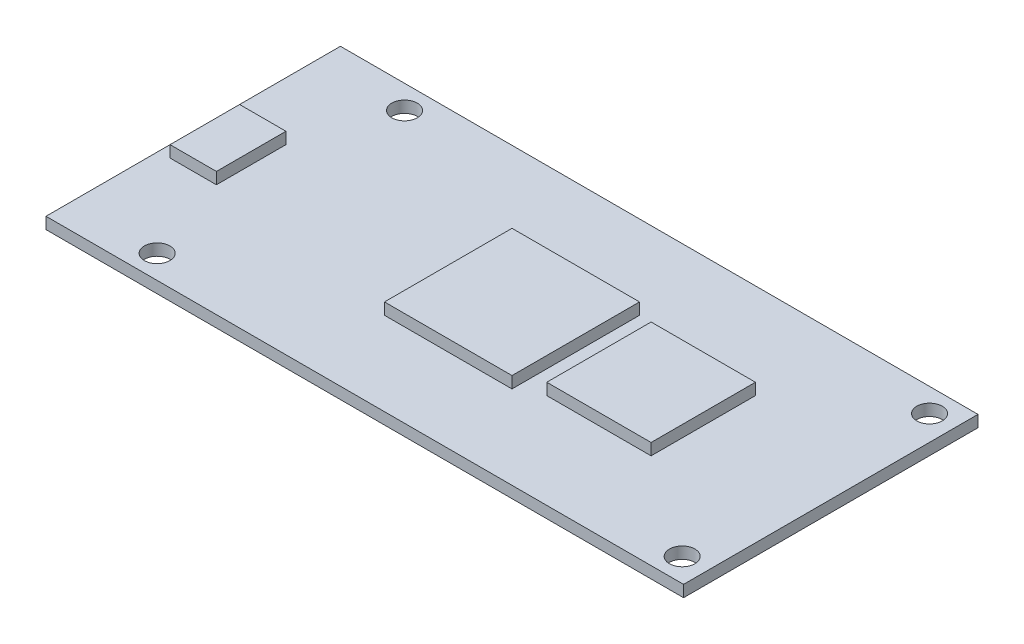
ISO-10303-21;
HEADER;
FILE_DESCRIPTION(('STEP AP214'),'2;1');
FILE_NAME('part.step','',(''),(''),'','','');
FILE_SCHEMA(('AUTOMOTIVE_DESIGN { 1 0 10303 214 1 1 1 1 }'));
ENDSEC;
DATA;
#1=APPLICATION_CONTEXT('core data for automotive mechanical design processes');
#2=APPLICATION_PROTOCOL_DEFINITION('international standard','automotive_design',2000,#1);
#3=PRODUCT_CONTEXT('',#1,'mechanical');
#4=PRODUCT('Part','Part','',(#3));
#5=PRODUCT_RELATED_PRODUCT_CATEGORY('part','',(#4));
#6=PRODUCT_DEFINITION_FORMATION('','',#4);
#7=PRODUCT_DEFINITION_CONTEXT('part definition',#1,'design');
#8=PRODUCT_DEFINITION('design','',#6,#7);
#9=PRODUCT_DEFINITION_SHAPE('','',#8);
#10=(LENGTH_UNIT() NAMED_UNIT(*) SI_UNIT(.MILLI.,.METRE.));
#11=(NAMED_UNIT(*) PLANE_ANGLE_UNIT() SI_UNIT($,.RADIAN.));
#12=(NAMED_UNIT(*) SI_UNIT($,.STERADIAN.) SOLID_ANGLE_UNIT());
#13=UNCERTAINTY_MEASURE_WITH_UNIT(LENGTH_MEASURE(1.E-05),#10,'distance_accuracy_value','');
#14=(GEOMETRIC_REPRESENTATION_CONTEXT(3) GLOBAL_UNCERTAINTY_ASSIGNED_CONTEXT((#13)) GLOBAL_UNIT_ASSIGNED_CONTEXT((#10,
#11,#12)) REPRESENTATION_CONTEXT('',''));
#15=CARTESIAN_POINT('',(0.,0.,0.));
#16=DIRECTION('',(0.,0.,1.));
#17=DIRECTION('',(1.,0.,0.));
#18=AXIS2_PLACEMENT_3D('',#15,#16,#17);
#19=CARTESIAN_POINT('',(27.5,1.,0.));
#20=DIRECTION('',(1.,0.,0.));
#21=DIRECTION('',(0.,0.,-1.));
#22=AXIS2_PLACEMENT_3D('',#19,#20,#21);
#23=PLANE('',#22);
#24=DIRECTION('',(0.,0.,1.));
#25=VECTOR('',#24,1.);
#26=CARTESIAN_POINT('',(27.5,0.,0.));
#27=LINE('',#26,#25);
#28=CARTESIAN_POINT('',(27.5,0.,-12.7));
#29=VERTEX_POINT('',#28);
#30=CARTESIAN_POINT('',(27.5,0.,12.7));
#31=VERTEX_POINT('',#30);
#32=EDGE_CURVE('E204',#29,#31,#27,.T.);
#33=ORIENTED_EDGE('',*,*,#32,.F.);
#34=DIRECTION('',(0.,-1.,0.));
#35=VECTOR('',#34,1.);
#36=CARTESIAN_POINT('',(27.5,1.,-12.7));
#37=LINE('',#36,#35);
#38=CARTESIAN_POINT('',(27.5,1.,-12.7));
#39=VERTEX_POINT('',#38);
#40=EDGE_CURVE('E11',#39,#29,#37,.T.);
#41=ORIENTED_EDGE('',*,*,#40,.F.);
#42=DIRECTION('',(0.,0.,1.));
#43=VECTOR('',#42,1.);
#44=CARTESIAN_POINT('',(27.5,1.,0.));
#45=LINE('',#44,#43);
#46=CARTESIAN_POINT('',(27.5,1.,12.7));
#47=VERTEX_POINT('',#46);
#48=EDGE_CURVE('E163',#39,#47,#45,.T.);
#49=ORIENTED_EDGE('',*,*,#48,.T.);
#50=DIRECTION('',(0.,-1.,0.));
#51=VECTOR('',#50,1.);
#52=CARTESIAN_POINT('',(27.5,1.,12.7));
#53=LINE('',#52,#51);
#54=EDGE_CURVE('E81',#47,#31,#53,.T.);
#55=ORIENTED_EDGE('',*,*,#54,.T.);
#56=EDGE_LOOP('',(#33,#41,#49,#55));
#57=FACE_BOUND('',#56,.T.);
#58=ADVANCED_FACE('F39',(#57),#23,.T.);
#59=CARTESIAN_POINT('',(0.,1.,-12.7));
#60=DIRECTION('',(0.,0.,-1.));
#61=DIRECTION('',(-1.,0.,0.));
#62=AXIS2_PLACEMENT_3D('',#59,#60,#61);
#63=PLANE('',#62);
#64=DIRECTION('',(1.,0.,0.));
#65=VECTOR('',#64,1.);
#66=CARTESIAN_POINT('',(0.,0.,-12.7));
#67=LINE('',#66,#65);
#68=CARTESIAN_POINT('',(-27.5,0.,-12.7));
#69=VERTEX_POINT('',#68);
#70=EDGE_CURVE('E206',#69,#29,#67,.T.);
#71=ORIENTED_EDGE('',*,*,#70,.F.);
#72=DIRECTION('',(0.,-1.,0.));
#73=VECTOR('',#72,1.);
#74=CARTESIAN_POINT('',(-27.5,1.,-12.7));
#75=LINE('',#74,#73);
#76=CARTESIAN_POINT('',(-27.5,1.,-12.7));
#77=VERTEX_POINT('',#76);
#78=EDGE_CURVE('E48',#77,#69,#75,.T.);
#79=ORIENTED_EDGE('',*,*,#78,.F.);
#80=DIRECTION('',(1.,0.,0.));
#81=VECTOR('',#80,1.);
#82=CARTESIAN_POINT('',(0.,1.,-12.7));
#83=LINE('',#82,#81);
#84=EDGE_CURVE('E165',#77,#39,#83,.T.);
#85=ORIENTED_EDGE('',*,*,#84,.T.);
#86=ORIENTED_EDGE('',*,*,#40,.T.);
#87=EDGE_LOOP('',(#71,#79,#85,#86));
#88=FACE_BOUND('',#87,.T.);
#89=ADVANCED_FACE('F226',(#88),#63,.T.);
#90=CARTESIAN_POINT('',(-27.5,1.,0.));
#91=DIRECTION('',(1.,0.,0.));
#92=DIRECTION('',(0.,0.,-1.));
#93=AXIS2_PLACEMENT_3D('',#90,#91,#92);
#94=PLANE('',#93);
#95=DIRECTION('',(0.,0.,1.));
#96=VECTOR('',#95,1.);
#97=CARTESIAN_POINT('',(-27.5,0.,0.));
#98=LINE('',#97,#96);
#99=CARTESIAN_POINT('',(-27.5,0.,12.7));
#100=VERTEX_POINT('',#99);
#101=EDGE_CURVE('E209',#69,#100,#98,.T.);
#102=ORIENTED_EDGE('',*,*,#101,.T.);
#103=DIRECTION('',(0.,-1.,0.));
#104=VECTOR('',#103,1.);
#105=CARTESIAN_POINT('',(-27.5,1.,12.7));
#106=LINE('',#105,#104);
#107=CARTESIAN_POINT('',(-27.5,1.,12.7));
#108=VERTEX_POINT('',#107);
#109=EDGE_CURVE('E216',#108,#100,#106,.T.);
#110=ORIENTED_EDGE('',*,*,#109,.F.);
#111=DIRECTION('',(0.,0.,1.));
#112=VECTOR('',#111,1.);
#113=CARTESIAN_POINT('',(-27.5,1.,0.));
#114=LINE('',#113,#112);
#115=EDGE_CURVE('E168',#77,#108,#114,.T.);
#116=ORIENTED_EDGE('',*,*,#115,.F.);
#117=ORIENTED_EDGE('',*,*,#78,.T.);
#118=EDGE_LOOP('',(#102,#110,#116,#117));
#119=FACE_BOUND('',#118,.T.);
#120=ADVANCED_FACE('F219',(#119),#94,.F.);
#121=CARTESIAN_POINT('',(0.,1.,12.7));
#122=DIRECTION('',(0.,0.,-1.));
#123=DIRECTION('',(-1.,0.,0.));
#124=AXIS2_PLACEMENT_3D('',#121,#122,#123);
#125=PLANE('',#124);
#126=DIRECTION('',(1.,0.,0.));
#127=VECTOR('',#126,1.);
#128=CARTESIAN_POINT('',(0.,0.,12.7));
#129=LINE('',#128,#127);
#130=EDGE_CURVE('E73',#100,#31,#129,.T.);
#131=ORIENTED_EDGE('',*,*,#130,.T.);
#132=ORIENTED_EDGE('',*,*,#54,.F.);
#133=DIRECTION('',(1.,0.,0.));
#134=VECTOR('',#133,1.);
#135=CARTESIAN_POINT('',(0.,1.,12.7));
#136=LINE('',#135,#134);
#137=EDGE_CURVE('E171',#108,#47,#136,.T.);
#138=ORIENTED_EDGE('',*,*,#137,.F.);
#139=ORIENTED_EDGE('',*,*,#109,.T.);
#140=EDGE_LOOP('',(#131,#132,#138,#139));
#141=FACE_BOUND('',#140,.T.);
#142=ADVANCED_FACE('F238',(#141),#125,.F.);
#143=CARTESIAN_POINT('',(-19.94,1.,-10.67));
#144=DIRECTION('',(0.,-1.,0.));
#145=DIRECTION('',(0.,0.,-1.));
#146=AXIS2_PLACEMENT_3D('',#143,#144,#145);
#147=CYLINDRICAL_SURFACE('',#146,1.1);
#148=CARTESIAN_POINT('',(-19.94,1.,-10.67));
#149=DIRECTION('',(0.,1.,0.));
#150=DIRECTION('',(0.,0.,1.));
#151=AXIS2_PLACEMENT_3D('',#148,#149,#150);
#152=CIRCLE('',#151,1.1);
#153=CARTESIAN_POINT('',(-19.94,1.,-9.57));
#154=VERTEX_POINT('',#153);
#155=EDGE_CURVE('E160',#154,#154,#152,.T.);
#156=ORIENTED_EDGE('',*,*,#155,.T.);
#157=EDGE_LOOP('',(#156));
#158=FACE_BOUND('',#157,.T.);
#159=CARTESIAN_POINT('',(-19.94,0.,-10.67));
#160=DIRECTION('',(0.,1.,0.));
#161=DIRECTION('',(0.,0.,1.));
#162=AXIS2_PLACEMENT_3D('',#159,#160,#161);
#163=CIRCLE('',#162,1.1);
#164=CARTESIAN_POINT('',(-19.94,0.,-9.57));
#165=VERTEX_POINT('',#164);
#166=EDGE_CURVE('E201',#165,#165,#163,.T.);
#167=ORIENTED_EDGE('',*,*,#166,.F.);
#168=EDGE_LOOP('',(#167));
#169=FACE_BOUND('',#168,.T.);
#170=ADVANCED_FACE('F235',(#158,#169),#147,.F.);
#171=CARTESIAN_POINT('',(25.35,1.,-10.67));
#172=DIRECTION('',(0.,-1.,0.));
#173=DIRECTION('',(0.,0.,-1.));
#174=AXIS2_PLACEMENT_3D('',#171,#172,#173);
#175=CYLINDRICAL_SURFACE('',#174,1.1);
#176=CARTESIAN_POINT('',(25.35,1.,-10.67));
#177=DIRECTION('',(0.,1.,0.));
#178=DIRECTION('',(0.,0.,1.));
#179=AXIS2_PLACEMENT_3D('',#176,#177,#178);
#180=CIRCLE('',#179,1.1);
#181=CARTESIAN_POINT('',(25.35,1.,-9.57));
#182=VERTEX_POINT('',#181);
#183=EDGE_CURVE('E156',#182,#182,#180,.T.);
#184=ORIENTED_EDGE('',*,*,#183,.T.);
#185=EDGE_LOOP('',(#184));
#186=FACE_BOUND('',#185,.T.);
#187=CARTESIAN_POINT('',(25.35,0.,-10.67));
#188=DIRECTION('',(0.,1.,0.));
#189=DIRECTION('',(0.,0.,1.));
#190=AXIS2_PLACEMENT_3D('',#187,#188,#189);
#191=CIRCLE('',#190,1.1);
#192=CARTESIAN_POINT('',(25.35,0.,-9.57));
#193=VERTEX_POINT('',#192);
#194=EDGE_CURVE('E147',#193,#193,#191,.T.);
#195=ORIENTED_EDGE('',*,*,#194,.F.);
#196=EDGE_LOOP('',(#195));
#197=FACE_BOUND('',#196,.T.);
#198=ADVANCED_FACE('F237',(#186,#197),#175,.F.);
#199=CARTESIAN_POINT('',(25.35,1.,10.67));
#200=DIRECTION('',(0.,-1.,0.));
#201=DIRECTION('',(0.,0.,-1.));
#202=AXIS2_PLACEMENT_3D('',#199,#200,#201);
#203=CYLINDRICAL_SURFACE('',#202,1.1);
#204=CARTESIAN_POINT('',(25.35,1.,10.67));
#205=DIRECTION('',(0.,1.,0.));
#206=DIRECTION('',(0.,0.,1.));
#207=AXIS2_PLACEMENT_3D('',#204,#205,#206);
#208=CIRCLE('',#207,1.1);
#209=CARTESIAN_POINT('',(25.35,1.,11.77));
#210=VERTEX_POINT('',#209);
#211=EDGE_CURVE('E153',#210,#210,#208,.F.);
#212=ORIENTED_EDGE('',*,*,#211,.F.);
#213=EDGE_LOOP('',(#212));
#214=FACE_BOUND('',#213,.T.);
#215=CARTESIAN_POINT('',(25.35,0.,10.67));
#216=DIRECTION('',(0.,1.,0.));
#217=DIRECTION('',(0.,0.,1.));
#218=AXIS2_PLACEMENT_3D('',#215,#216,#217);
#219=CIRCLE('',#218,1.1);
#220=CARTESIAN_POINT('',(25.35,0.,11.77));
#221=VERTEX_POINT('',#220);
#222=EDGE_CURVE('E143',#221,#221,#219,.F.);
#223=ORIENTED_EDGE('',*,*,#222,.T.);
#224=EDGE_LOOP('',(#223));
#225=FACE_BOUND('',#224,.T.);
#226=ADVANCED_FACE('F41',(#214,#225),#203,.F.);
#227=CARTESIAN_POINT('',(-19.94,1.,10.67));
#228=DIRECTION('',(0.,-1.,0.));
#229=DIRECTION('',(0.,0.,-1.));
#230=AXIS2_PLACEMENT_3D('',#227,#228,#229);
#231=CYLINDRICAL_SURFACE('',#230,1.1);
#232=CARTESIAN_POINT('',(-19.94,1.,10.67));
#233=DIRECTION('',(0.,1.,0.));
#234=DIRECTION('',(0.,0.,1.));
#235=AXIS2_PLACEMENT_3D('',#232,#233,#234);
#236=CIRCLE('',#235,1.1);
#237=CARTESIAN_POINT('',(-19.94,1.,11.77));
#238=VERTEX_POINT('',#237);
#239=EDGE_CURVE('E196',#238,#238,#236,.F.);
#240=ORIENTED_EDGE('',*,*,#239,.F.);
#241=EDGE_LOOP('',(#240));
#242=FACE_BOUND('',#241,.T.);
#243=CARTESIAN_POINT('',(-19.94,0.,10.67));
#244=DIRECTION('',(0.,1.,0.));
#245=DIRECTION('',(0.,0.,1.));
#246=AXIS2_PLACEMENT_3D('',#243,#244,#245);
#247=CIRCLE('',#246,1.1);
#248=CARTESIAN_POINT('',(-19.94,0.,11.77));
#249=VERTEX_POINT('',#248);
#250=EDGE_CURVE('E157',#249,#249,#247,.F.);
#251=ORIENTED_EDGE('',*,*,#250,.T.);
#252=EDGE_LOOP('',(#251));
#253=FACE_BOUND('',#252,.T.);
#254=ADVANCED_FACE('F245',(#242,#253),#231,.F.);
#255=CARTESIAN_POINT('',(0.,1.,0.));
#256=DIRECTION('',(0.,1.,0.));
#257=DIRECTION('',(0.,0.,1.));
#258=AXIS2_PLACEMENT_3D('',#255,#256,#257);
#259=PLANE('',#258);
#260=ORIENTED_EDGE('',*,*,#211,.T.);
#261=EDGE_LOOP('',(#260));
#262=FACE_BOUND('',#261,.T.);
#263=ORIENTED_EDGE('',*,*,#183,.F.);
#264=EDGE_LOOP('',(#263));
#265=FACE_BOUND('',#264,.T.);
#266=ORIENTED_EDGE('',*,*,#155,.F.);
#267=EDGE_LOOP('',(#266));
#268=FACE_BOUND('',#267,.T.);
#269=ORIENTED_EDGE('',*,*,#48,.F.);
#270=ORIENTED_EDGE('',*,*,#84,.F.);
#271=ORIENTED_EDGE('',*,*,#115,.T.);
#272=ORIENTED_EDGE('',*,*,#137,.T.);
#273=EDGE_LOOP('',(#269,#270,#271,#272));
#274=FACE_BOUND('',#273,.T.);
#275=DIRECTION('',(1.,0.,0.));
#276=VECTOR('',#275,1.);
#277=CARTESIAN_POINT('',(0.,1.,-5.5));
#278=LINE('',#277,#276);
#279=CARTESIAN_POINT('',(-5.5,1.,-5.5));
#280=VERTEX_POINT('',#279);
#281=CARTESIAN_POINT('',(5.5,1.,-5.5));
#282=VERTEX_POINT('',#281);
#283=EDGE_CURVE('E173',#280,#282,#278,.T.);
#284=ORIENTED_EDGE('',*,*,#283,.T.);
#285=DIRECTION('',(0.,0.,1.));
#286=VECTOR('',#285,1.);
#287=CARTESIAN_POINT('',(5.5,1.,0.));
#288=LINE('',#287,#286);
#289=CARTESIAN_POINT('',(5.5,1.,5.5));
#290=VERTEX_POINT('',#289);
#291=EDGE_CURVE('E175',#282,#290,#288,.T.);
#292=ORIENTED_EDGE('',*,*,#291,.T.);
#293=DIRECTION('',(1.,0.,0.));
#294=VECTOR('',#293,1.);
#295=CARTESIAN_POINT('',(0.,1.,5.5));
#296=LINE('',#295,#294);
#297=CARTESIAN_POINT('',(-5.5,1.,5.5));
#298=VERTEX_POINT('',#297);
#299=EDGE_CURVE('E178',#298,#290,#296,.T.);
#300=ORIENTED_EDGE('',*,*,#299,.F.);
#301=DIRECTION('',(0.,0.,1.));
#302=VECTOR('',#301,1.);
#303=CARTESIAN_POINT('',(-5.5,1.,0.));
#304=LINE('',#303,#302);
#305=EDGE_CURVE('E181',#280,#298,#304,.T.);
#306=ORIENTED_EDGE('',*,*,#305,.F.);
#307=EDGE_LOOP('',(#284,#292,#300,#306));
#308=FACE_BOUND('',#307,.T.);
#309=DIRECTION('',(1.,0.,0.));
#310=VECTOR('',#309,1.);
#311=CARTESIAN_POINT('',(0.,1.,-4.5));
#312=LINE('',#311,#310);
#313=CARTESIAN_POINT('',(7.5,1.,-4.5));
#314=VERTEX_POINT('',#313);
#315=CARTESIAN_POINT('',(16.5,1.,-4.5));
#316=VERTEX_POINT('',#315);
#317=EDGE_CURVE('E184',#314,#316,#312,.T.);
#318=ORIENTED_EDGE('',*,*,#317,.T.);
#319=DIRECTION('',(0.,0.,1.));
#320=VECTOR('',#319,1.);
#321=CARTESIAN_POINT('',(16.5,1.,0.));
#322=LINE('',#321,#320);
#323=CARTESIAN_POINT('',(16.5,1.,4.5));
#324=VERTEX_POINT('',#323);
#325=EDGE_CURVE('E186',#316,#324,#322,.T.);
#326=ORIENTED_EDGE('',*,*,#325,.T.);
#327=DIRECTION('',(1.,0.,0.));
#328=VECTOR('',#327,1.);
#329=CARTESIAN_POINT('',(0.,1.,4.5));
#330=LINE('',#329,#328);
#331=CARTESIAN_POINT('',(7.5,1.,4.5));
#332=VERTEX_POINT('',#331);
#333=EDGE_CURVE('E189',#332,#324,#330,.T.);
#334=ORIENTED_EDGE('',*,*,#333,.F.);
#335=DIRECTION('',(0.,0.,1.));
#336=VECTOR('',#335,1.);
#337=CARTESIAN_POINT('',(7.5,1.,0.));
#338=LINE('',#337,#336);
#339=EDGE_CURVE('E125',#314,#332,#338,.T.);
#340=ORIENTED_EDGE('',*,*,#339,.F.);
#341=EDGE_LOOP('',(#318,#326,#334,#340));
#342=FACE_BOUND('',#341,.T.);
#343=DIRECTION('',(1.,0.,0.));
#344=VECTOR('',#343,1.);
#345=CARTESIAN_POINT('',(0.,1.,-3.));
#346=LINE('',#345,#344);
#347=CARTESIAN_POINT('',(-26.5,1.,-3.));
#348=VERTEX_POINT('',#347);
#349=CARTESIAN_POINT('',(-22.5,1.,-3.));
#350=VERTEX_POINT('',#349);
#351=EDGE_CURVE('E115',#348,#350,#346,.T.);
#352=ORIENTED_EDGE('',*,*,#351,.T.);
#353=DIRECTION('',(0.,0.,1.));
#354=VECTOR('',#353,1.);
#355=CARTESIAN_POINT('',(-22.5,1.,0.));
#356=LINE('',#355,#354);
#357=CARTESIAN_POINT('',(-22.5,1.,3.));
#358=VERTEX_POINT('',#357);
#359=EDGE_CURVE('E119',#350,#358,#356,.T.);
#360=ORIENTED_EDGE('',*,*,#359,.T.);
#361=DIRECTION('',(1.,0.,0.));
#362=VECTOR('',#361,1.);
#363=CARTESIAN_POINT('',(0.,1.,3.));
#364=LINE('',#363,#362);
#365=CARTESIAN_POINT('',(-26.5,1.,3.));
#366=VERTEX_POINT('',#365);
#367=EDGE_CURVE('E137',#366,#358,#364,.T.);
#368=ORIENTED_EDGE('',*,*,#367,.F.);
#369=DIRECTION('',(0.,0.,1.));
#370=VECTOR('',#369,1.);
#371=CARTESIAN_POINT('',(-26.5,1.,0.));
#372=LINE('',#371,#370);
#373=EDGE_CURVE('E56',#348,#366,#372,.T.);
#374=ORIENTED_EDGE('',*,*,#373,.F.);
#375=EDGE_LOOP('',(#352,#360,#368,#374));
#376=FACE_BOUND('',#375,.T.);
#377=ORIENTED_EDGE('',*,*,#239,.T.);
#378=EDGE_LOOP('',(#377));
#379=FACE_BOUND('',#378,.T.);
#380=ADVANCED_FACE('F117',(#262,#265,#268,#274,#308,#342,#376,#379),#259,.T.);
#381=CARTESIAN_POINT('',(0.,0.,0.));
#382=DIRECTION('',(0.,1.,0.));
#383=DIRECTION('',(0.,0.,1.));
#384=AXIS2_PLACEMENT_3D('',#381,#382,#383);
#385=PLANE('',#384);
#386=ORIENTED_EDGE('',*,*,#222,.F.);
#387=EDGE_LOOP('',(#386));
#388=FACE_BOUND('',#387,.T.);
#389=ORIENTED_EDGE('',*,*,#194,.T.);
#390=EDGE_LOOP('',(#389));
#391=FACE_BOUND('',#390,.T.);
#392=ORIENTED_EDGE('',*,*,#166,.T.);
#393=EDGE_LOOP('',(#392));
#394=FACE_BOUND('',#393,.T.);
#395=ORIENTED_EDGE('',*,*,#32,.T.);
#396=ORIENTED_EDGE('',*,*,#130,.F.);
#397=ORIENTED_EDGE('',*,*,#101,.F.);
#398=ORIENTED_EDGE('',*,*,#70,.T.);
#399=EDGE_LOOP('',(#395,#396,#397,#398));
#400=FACE_BOUND('',#399,.T.);
#401=ORIENTED_EDGE('',*,*,#250,.F.);
#402=EDGE_LOOP('',(#401));
#403=FACE_BOUND('',#402,.T.);
#404=ADVANCED_FACE('F224',(#388,#391,#394,#400,#403),#385,.F.);
#405=CARTESIAN_POINT('',(-22.5,2.,0.));
#406=DIRECTION('',(1.,0.,0.));
#407=DIRECTION('',(0.,0.,-1.));
#408=AXIS2_PLACEMENT_3D('',#405,#406,#407);
#409=PLANE('',#408);
#410=DIRECTION('',(0.,-1.,0.));
#411=VECTOR('',#410,1.);
#412=CARTESIAN_POINT('',(-22.5,2.,3.));
#413=LINE('',#412,#411);
#414=CARTESIAN_POINT('',(-22.5,2.,3.));
#415=VERTEX_POINT('',#414);
#416=EDGE_CURVE('E136',#415,#358,#413,.T.);
#417=ORIENTED_EDGE('',*,*,#416,.T.);
#418=ORIENTED_EDGE('',*,*,#359,.F.);
#419=DIRECTION('',(0.,-1.,0.));
#420=VECTOR('',#419,1.);
#421=CARTESIAN_POINT('',(-22.5,2.,-3.));
#422=LINE('',#421,#420);
#423=CARTESIAN_POINT('',(-22.5,2.,-3.));
#424=VERTEX_POINT('',#423);
#425=EDGE_CURVE('E133',#424,#350,#422,.T.);
#426=ORIENTED_EDGE('',*,*,#425,.F.);
#427=DIRECTION('',(0.,0.,1.));
#428=VECTOR('',#427,1.);
#429=CARTESIAN_POINT('',(-22.5,2.,0.));
#430=LINE('',#429,#428);
#431=EDGE_CURVE('E554',#424,#415,#430,.T.);
#432=ORIENTED_EDGE('',*,*,#431,.T.);
#433=EDGE_LOOP('',(#417,#418,#426,#432));
#434=FACE_BOUND('',#433,.T.);
#435=ADVANCED_FACE('F130',(#434),#409,.T.);
#436=CARTESIAN_POINT('',(0.,2.,-3.));
#437=DIRECTION('',(0.,0.,-1.));
#438=DIRECTION('',(-1.,0.,0.));
#439=AXIS2_PLACEMENT_3D('',#436,#437,#438);
#440=PLANE('',#439);
#441=ORIENTED_EDGE('',*,*,#425,.T.);
#442=ORIENTED_EDGE('',*,*,#351,.F.);
#443=DIRECTION('',(0.,-1.,0.));
#444=VECTOR('',#443,1.);
#445=CARTESIAN_POINT('',(-26.5,2.,-3.));
#446=LINE('',#445,#444);
#447=CARTESIAN_POINT('',(-26.5,2.,-3.));
#448=VERTEX_POINT('',#447);
#449=EDGE_CURVE('E144',#448,#348,#446,.T.);
#450=ORIENTED_EDGE('',*,*,#449,.F.);
#451=DIRECTION('',(1.,0.,0.));
#452=VECTOR('',#451,1.);
#453=CARTESIAN_POINT('',(0.,2.,-3.));
#454=LINE('',#453,#452);
#455=EDGE_CURVE('E142',#448,#424,#454,.T.);
#456=ORIENTED_EDGE('',*,*,#455,.T.);
#457=EDGE_LOOP('',(#441,#442,#450,#456));
#458=FACE_BOUND('',#457,.T.);
#459=ADVANCED_FACE('F140',(#458),#440,.T.);
#460=CARTESIAN_POINT('',(-26.5,2.,0.));
#461=DIRECTION('',(1.,0.,0.));
#462=DIRECTION('',(0.,0.,-1.));
#463=AXIS2_PLACEMENT_3D('',#460,#461,#462);
#464=PLANE('',#463);
#465=ORIENTED_EDGE('',*,*,#373,.T.);
#466=DIRECTION('',(0.,-1.,0.));
#467=VECTOR('',#466,1.);
#468=CARTESIAN_POINT('',(-26.5,2.,3.));
#469=LINE('',#468,#467);
#470=CARTESIAN_POINT('',(-26.5,2.,3.));
#471=VERTEX_POINT('',#470);
#472=EDGE_CURVE('E149',#471,#366,#469,.T.);
#473=ORIENTED_EDGE('',*,*,#472,.F.);
#474=DIRECTION('',(0.,0.,1.));
#475=VECTOR('',#474,1.);
#476=CARTESIAN_POINT('',(-26.5,2.,0.));
#477=LINE('',#476,#475);
#478=EDGE_CURVE('E557',#448,#471,#477,.T.);
#479=ORIENTED_EDGE('',*,*,#478,.F.);
#480=ORIENTED_EDGE('',*,*,#449,.T.);
#481=EDGE_LOOP('',(#465,#473,#479,#480));
#482=FACE_BOUND('',#481,.T.);
#483=ADVANCED_FACE('F334',(#482),#464,.F.);
#484=CARTESIAN_POINT('',(0.,2.,3.));
#485=DIRECTION('',(0.,0.,-1.));
#486=DIRECTION('',(-1.,0.,0.));
#487=AXIS2_PLACEMENT_3D('',#484,#485,#486);
#488=PLANE('',#487);
#489=ORIENTED_EDGE('',*,*,#367,.T.);
#490=ORIENTED_EDGE('',*,*,#416,.F.);
#491=DIRECTION('',(1.,0.,0.));
#492=VECTOR('',#491,1.);
#493=CARTESIAN_POINT('',(0.,2.,3.));
#494=LINE('',#493,#492);
#495=EDGE_CURVE('E560',#471,#415,#494,.T.);
#496=ORIENTED_EDGE('',*,*,#495,.F.);
#497=ORIENTED_EDGE('',*,*,#472,.T.);
#498=EDGE_LOOP('',(#489,#490,#496,#497));
#499=FACE_BOUND('',#498,.T.);
#500=ADVANCED_FACE('F344',(#499),#488,.F.);
#501=CARTESIAN_POINT('',(0.,2.,0.));
#502=DIRECTION('',(0.,1.,0.));
#503=DIRECTION('',(0.,0.,1.));
#504=AXIS2_PLACEMENT_3D('',#501,#502,#503);
#505=PLANE('',#504);
#506=ORIENTED_EDGE('',*,*,#431,.F.);
#507=ORIENTED_EDGE('',*,*,#455,.F.);
#508=ORIENTED_EDGE('',*,*,#478,.T.);
#509=ORIENTED_EDGE('',*,*,#495,.T.);
#510=EDGE_LOOP('',(#506,#507,#508,#509));
#511=FACE_BOUND('',#510,.T.);
#512=ADVANCED_FACE('F355',(#511),#505,.T.);
#513=CARTESIAN_POINT('',(5.5,2.,0.));
#514=DIRECTION('',(1.,0.,0.));
#515=DIRECTION('',(0.,0.,-1.));
#516=AXIS2_PLACEMENT_3D('',#513,#514,#515);
#517=PLANE('',#516);
#518=DIRECTION('',(0.,-1.,0.));
#519=VECTOR('',#518,1.);
#520=CARTESIAN_POINT('',(5.5,2.,5.5));
#521=LINE('',#520,#519);
#522=CARTESIAN_POINT('',(5.5,2.,5.5));
#523=VERTEX_POINT('',#522);
#524=EDGE_CURVE('E542',#523,#290,#521,.T.);
#525=ORIENTED_EDGE('',*,*,#524,.T.);
#526=ORIENTED_EDGE('',*,*,#291,.F.);
#527=DIRECTION('',(0.,-1.,0.));
#528=VECTOR('',#527,1.);
#529=CARTESIAN_POINT('',(5.5,2.,-5.5));
#530=LINE('',#529,#528);
#531=CARTESIAN_POINT('',(5.5,2.,-5.5));
#532=VERTEX_POINT('',#531);
#533=EDGE_CURVE('E551',#532,#282,#530,.T.);
#534=ORIENTED_EDGE('',*,*,#533,.F.);
#535=DIRECTION('',(0.,0.,1.));
#536=VECTOR('',#535,1.);
#537=CARTESIAN_POINT('',(5.5,2.,0.));
#538=LINE('',#537,#536);
#539=EDGE_CURVE('E530',#532,#523,#538,.T.);
#540=ORIENTED_EDGE('',*,*,#539,.T.);
#541=EDGE_LOOP('',(#525,#526,#534,#540));
#542=FACE_BOUND('',#541,.T.);
#543=ADVANCED_FACE('F366',(#542),#517,.T.);
#544=CARTESIAN_POINT('',(0.,2.,-5.5));
#545=DIRECTION('',(0.,0.,-1.));
#546=DIRECTION('',(-1.,0.,0.));
#547=AXIS2_PLACEMENT_3D('',#544,#545,#546);
#548=PLANE('',#547);
#549=ORIENTED_EDGE('',*,*,#533,.T.);
#550=ORIENTED_EDGE('',*,*,#283,.F.);
#551=DIRECTION('',(0.,-1.,0.));
#552=VECTOR('',#551,1.);
#553=CARTESIAN_POINT('',(-5.5,2.,-5.5));
#554=LINE('',#553,#552);
#555=CARTESIAN_POINT('',(-5.5,2.,-5.5));
#556=VERTEX_POINT('',#555);
#557=EDGE_CURVE('E548',#556,#280,#554,.T.);
#558=ORIENTED_EDGE('',*,*,#557,.F.);
#559=DIRECTION('',(1.,0.,0.));
#560=VECTOR('',#559,1.);
#561=CARTESIAN_POINT('',(0.,2.,-5.5));
#562=LINE('',#561,#560);
#563=EDGE_CURVE('E533',#556,#532,#562,.T.);
#564=ORIENTED_EDGE('',*,*,#563,.T.);
#565=EDGE_LOOP('',(#549,#550,#558,#564));
#566=FACE_BOUND('',#565,.T.);
#567=ADVANCED_FACE('F377',(#566),#548,.T.);
#568=CARTESIAN_POINT('',(-5.5,2.,0.));
#569=DIRECTION('',(1.,0.,0.));
#570=DIRECTION('',(0.,0.,-1.));
#571=AXIS2_PLACEMENT_3D('',#568,#569,#570);
#572=PLANE('',#571);
#573=ORIENTED_EDGE('',*,*,#305,.T.);
#574=DIRECTION('',(0.,-1.,0.));
#575=VECTOR('',#574,1.);
#576=CARTESIAN_POINT('',(-5.5,2.,5.5));
#577=LINE('',#576,#575);
#578=CARTESIAN_POINT('',(-5.5,2.,5.5));
#579=VERTEX_POINT('',#578);
#580=EDGE_CURVE('E545',#579,#298,#577,.T.);
#581=ORIENTED_EDGE('',*,*,#580,.F.);
#582=DIRECTION('',(0.,0.,1.));
#583=VECTOR('',#582,1.);
#584=CARTESIAN_POINT('',(-5.5,2.,0.));
#585=LINE('',#584,#583);
#586=EDGE_CURVE('E536',#556,#579,#585,.T.);
#587=ORIENTED_EDGE('',*,*,#586,.F.);
#588=ORIENTED_EDGE('',*,*,#557,.T.);
#589=EDGE_LOOP('',(#573,#581,#587,#588));
#590=FACE_BOUND('',#589,.T.);
#591=ADVANCED_FACE('F388',(#590),#572,.F.);
#592=CARTESIAN_POINT('',(0.,2.,5.5));
#593=DIRECTION('',(0.,0.,-1.));
#594=DIRECTION('',(-1.,0.,0.));
#595=AXIS2_PLACEMENT_3D('',#592,#593,#594);
#596=PLANE('',#595);
#597=ORIENTED_EDGE('',*,*,#299,.T.);
#598=ORIENTED_EDGE('',*,*,#524,.F.);
#599=DIRECTION('',(1.,0.,0.));
#600=VECTOR('',#599,1.);
#601=CARTESIAN_POINT('',(0.,2.,5.5));
#602=LINE('',#601,#600);
#603=EDGE_CURVE('E539',#579,#523,#602,.T.);
#604=ORIENTED_EDGE('',*,*,#603,.F.);
#605=ORIENTED_EDGE('',*,*,#580,.T.);
#606=EDGE_LOOP('',(#597,#598,#604,#605));
#607=FACE_BOUND('',#606,.T.);
#608=ADVANCED_FACE('F400',(#607),#596,.F.);
#609=CARTESIAN_POINT('',(0.,2.,0.));
#610=DIRECTION('',(0.,1.,0.));
#611=DIRECTION('',(0.,0.,1.));
#612=AXIS2_PLACEMENT_3D('',#609,#610,#611);
#613=PLANE('',#612);
#614=ORIENTED_EDGE('',*,*,#539,.F.);
#615=ORIENTED_EDGE('',*,*,#563,.F.);
#616=ORIENTED_EDGE('',*,*,#586,.T.);
#617=ORIENTED_EDGE('',*,*,#603,.T.);
#618=EDGE_LOOP('',(#614,#615,#616,#617));
#619=FACE_BOUND('',#618,.T.);
#620=ADVANCED_FACE('F411',(#619),#613,.T.);
#621=CARTESIAN_POINT('',(16.5,2.,0.));
#622=DIRECTION('',(1.,0.,0.));
#623=DIRECTION('',(0.,0.,-1.));
#624=AXIS2_PLACEMENT_3D('',#621,#622,#623);
#625=PLANE('',#624);
#626=DIRECTION('',(0.,-1.,0.));
#627=VECTOR('',#626,1.);
#628=CARTESIAN_POINT('',(16.5,2.,4.5));
#629=LINE('',#628,#627);
#630=CARTESIAN_POINT('',(16.5,2.,4.5));
#631=VERTEX_POINT('',#630);
#632=EDGE_CURVE('E523',#631,#324,#629,.T.);
#633=ORIENTED_EDGE('',*,*,#632,.T.);
#634=ORIENTED_EDGE('',*,*,#325,.F.);
#635=DIRECTION('',(0.,-1.,0.));
#636=VECTOR('',#635,1.);
#637=CARTESIAN_POINT('',(16.5,2.,-4.5));
#638=LINE('',#637,#636);
#639=CARTESIAN_POINT('',(16.5,2.,-4.5));
#640=VERTEX_POINT('',#639);
#641=EDGE_CURVE('E514',#640,#316,#638,.T.);
#642=ORIENTED_EDGE('',*,*,#641,.F.);
#643=DIRECTION('',(0.,0.,1.));
#644=VECTOR('',#643,1.);
#645=CARTESIAN_POINT('',(16.5,2.,0.));
#646=LINE('',#645,#644);
#647=EDGE_CURVE('E498',#640,#631,#646,.T.);
#648=ORIENTED_EDGE('',*,*,#647,.T.);
#649=EDGE_LOOP('',(#633,#634,#642,#648));
#650=FACE_BOUND('',#649,.T.);
#651=ADVANCED_FACE('F421',(#650),#625,.T.);
#652=CARTESIAN_POINT('',(0.,2.,-4.5));
#653=DIRECTION('',(0.,0.,-1.));
#654=DIRECTION('',(-1.,0.,0.));
#655=AXIS2_PLACEMENT_3D('',#652,#653,#654);
#656=PLANE('',#655);
#657=ORIENTED_EDGE('',*,*,#641,.T.);
#658=ORIENTED_EDGE('',*,*,#317,.F.);
#659=DIRECTION('',(0.,-1.,0.));
#660=VECTOR('',#659,1.);
#661=CARTESIAN_POINT('',(7.5,2.,-4.5));
#662=LINE('',#661,#660);
#663=CARTESIAN_POINT('',(7.5,2.,-4.5));
#664=VERTEX_POINT('',#663);
#665=EDGE_CURVE('E516',#664,#314,#662,.T.);
#666=ORIENTED_EDGE('',*,*,#665,.F.);
#667=DIRECTION('',(1.,0.,0.));
#668=VECTOR('',#667,1.);
#669=CARTESIAN_POINT('',(0.,2.,-4.5));
#670=LINE('',#669,#668);
#671=EDGE_CURVE('E502',#664,#640,#670,.T.);
#672=ORIENTED_EDGE('',*,*,#671,.T.);
#673=EDGE_LOOP('',(#657,#658,#666,#672));
#674=FACE_BOUND('',#673,.T.);
#675=ADVANCED_FACE('F431',(#674),#656,.T.);
#676=CARTESIAN_POINT('',(7.5,2.,0.));
#677=DIRECTION('',(1.,0.,0.));
#678=DIRECTION('',(0.,0.,-1.));
#679=AXIS2_PLACEMENT_3D('',#676,#677,#678);
#680=PLANE('',#679);
#681=ORIENTED_EDGE('',*,*,#339,.T.);
#682=DIRECTION('',(0.,-1.,0.));
#683=VECTOR('',#682,1.);
#684=CARTESIAN_POINT('',(7.5,2.,4.5));
#685=LINE('',#684,#683);
#686=CARTESIAN_POINT('',(7.5,2.,4.5));
#687=VERTEX_POINT('',#686);
#688=EDGE_CURVE('E525',#687,#332,#685,.T.);
#689=ORIENTED_EDGE('',*,*,#688,.F.);
#690=DIRECTION('',(0.,0.,1.));
#691=VECTOR('',#690,1.);
#692=CARTESIAN_POINT('',(7.5,2.,0.));
#693=LINE('',#692,#691);
#694=EDGE_CURVE('E518',#664,#687,#693,.T.);
#695=ORIENTED_EDGE('',*,*,#694,.F.);
#696=ORIENTED_EDGE('',*,*,#665,.T.);
#697=EDGE_LOOP('',(#681,#689,#695,#696));
#698=FACE_BOUND('',#697,.T.);
#699=ADVANCED_FACE('F443',(#698),#680,.F.);
#700=CARTESIAN_POINT('',(0.,2.,4.5));
#701=DIRECTION('',(0.,0.,-1.));
#702=DIRECTION('',(-1.,0.,0.));
#703=AXIS2_PLACEMENT_3D('',#700,#701,#702);
#704=PLANE('',#703);
#705=ORIENTED_EDGE('',*,*,#333,.T.);
#706=ORIENTED_EDGE('',*,*,#632,.F.);
#707=DIRECTION('',(1.,0.,0.));
#708=VECTOR('',#707,1.);
#709=CARTESIAN_POINT('',(0.,2.,4.5));
#710=LINE('',#709,#708);
#711=EDGE_CURVE('E505',#687,#631,#710,.T.);
#712=ORIENTED_EDGE('',*,*,#711,.F.);
#713=ORIENTED_EDGE('',*,*,#688,.T.);
#714=EDGE_LOOP('',(#705,#706,#712,#713));
#715=FACE_BOUND('',#714,.T.);
#716=ADVANCED_FACE('F454',(#715),#704,.F.);
#717=CARTESIAN_POINT('',(0.,2.,0.));
#718=DIRECTION('',(0.,1.,0.));
#719=DIRECTION('',(0.,0.,1.));
#720=AXIS2_PLACEMENT_3D('',#717,#718,#719);
#721=PLANE('',#720);
#722=ORIENTED_EDGE('',*,*,#647,.F.);
#723=ORIENTED_EDGE('',*,*,#671,.F.);
#724=ORIENTED_EDGE('',*,*,#694,.T.);
#725=ORIENTED_EDGE('',*,*,#711,.T.);
#726=EDGE_LOOP('',(#722,#723,#724,#725));
#727=FACE_BOUND('',#726,.T.);
#728=ADVANCED_FACE('F464',(#727),#721,.T.);
#729=CLOSED_SHELL('',(#58,#89,#120,#142,#170,#198,#226,#254,#380,#404,#435,#459,#483,#500,#512,
#543,#567,#591,#608,#620,#651,#675,#699,#716,#728));
#730=MANIFOLD_SOLID_BREP('B2',#729);
#731=ADVANCED_BREP_SHAPE_REPRESENTATION('',(#18,#730),#14);
#732=SHAPE_DEFINITION_REPRESENTATION(#9,#731);
ENDSEC;
END-ISO-10303-21;
